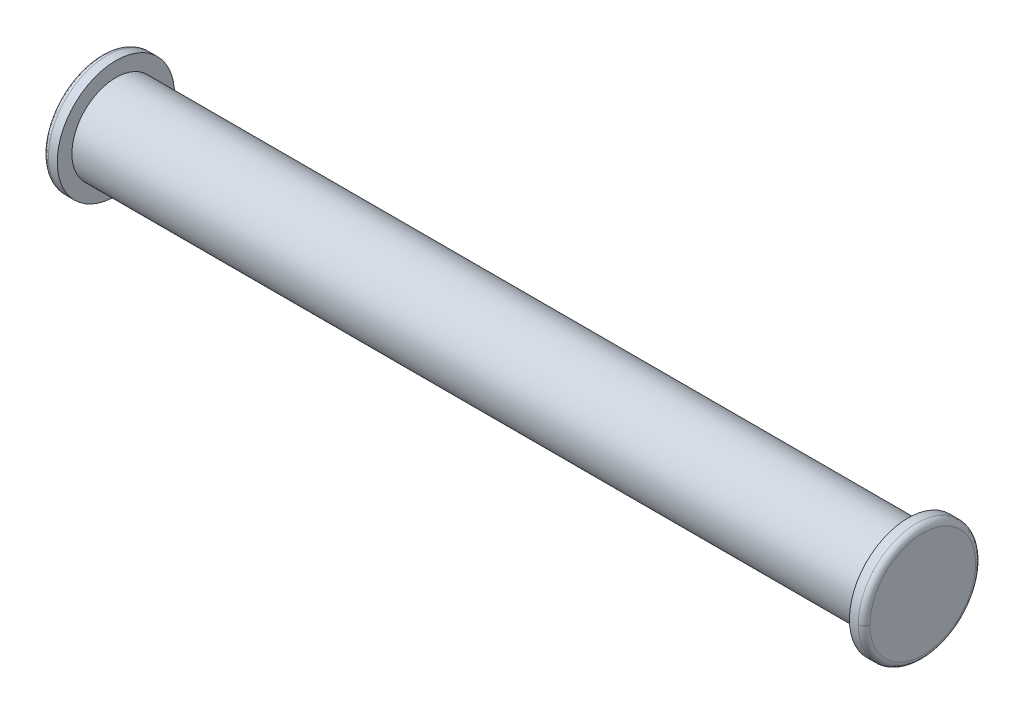
ISO-10303-21;
HEADER;
FILE_DESCRIPTION(('STEP AP214'),'2;1');
FILE_NAME('part.step','',(''),(''),'','','');
FILE_SCHEMA(('AUTOMOTIVE_DESIGN { 1 0 10303 214 1 1 1 1 }'));
ENDSEC;
DATA;
#1=APPLICATION_CONTEXT('core data for automotive mechanical design processes');
#2=APPLICATION_PROTOCOL_DEFINITION('international standard','automotive_design',2000,#1);
#3=PRODUCT_CONTEXT('',#1,'mechanical');
#4=PRODUCT('Part','Part','',(#3));
#5=PRODUCT_RELATED_PRODUCT_CATEGORY('part','',(#4));
#6=PRODUCT_DEFINITION_FORMATION('','',#4);
#7=PRODUCT_DEFINITION_CONTEXT('part definition',#1,'design');
#8=PRODUCT_DEFINITION('design','',#6,#7);
#9=PRODUCT_DEFINITION_SHAPE('','',#8);
#10=(LENGTH_UNIT() NAMED_UNIT(*) SI_UNIT(.MILLI.,.METRE.));
#11=(NAMED_UNIT(*) PLANE_ANGLE_UNIT() SI_UNIT($,.RADIAN.));
#12=(NAMED_UNIT(*) SI_UNIT($,.STERADIAN.) SOLID_ANGLE_UNIT());
#13=UNCERTAINTY_MEASURE_WITH_UNIT(LENGTH_MEASURE(1.E-05),#10,'distance_accuracy_value','');
#14=(GEOMETRIC_REPRESENTATION_CONTEXT(3) GLOBAL_UNCERTAINTY_ASSIGNED_CONTEXT((#13)) GLOBAL_UNIT_ASSIGNED_CONTEXT((#10,
#11,#12)) REPRESENTATION_CONTEXT('',''));
#15=CARTESIAN_POINT('',(0.,0.,0.));
#16=DIRECTION('',(0.,0.,1.));
#17=DIRECTION('',(1.,0.,0.));
#18=AXIS2_PLACEMENT_3D('',#15,#16,#17);
#19=CARTESIAN_POINT('',(14.,-1.8216,1.8216));
#20=DIRECTION('',(1.,0.,0.));
#21=DIRECTION('',(0.,0.,-1.));
#22=AXIS2_PLACEMENT_3D('',#19,#20,#21);
#23=PLANE('',#22);
#24=CARTESIAN_POINT('',(14.0000000000116,0.,1.80000000059265));
#25=CARTESIAN_POINT('',(14.0000000000116,3.60000000031685,1.80000000059265));
#26=CARTESIAN_POINT('',(14.0000000000116,3.60000000031685,-1.80000000059265));
#27=CARTESIAN_POINT('',(14.0000000000116,0.,-1.80000000059265));
#28=(BOUNDED_CURVE() B_SPLINE_CURVE(3,(#24,#25,#26,#27),.UNSPECIFIED.,.F.,
.F.) B_SPLINE_CURVE_WITH_KNOTS((4,4),(0.,1.),
.UNSPECIFIED.) CURVE() GEOMETRIC_REPRESENTATION_ITEM() RATIONAL_B_SPLINE_CURVE((0.956578301732849,
0.318859433910949,0.318859433910949,0.956578301732849)) REPRESENTATION_ITEM(''));
#29=CARTESIAN_POINT('',(14.000000000007,0.,1.79999999995475));
#30=VERTEX_POINT('',#29);
#31=CARTESIAN_POINT('',(14.000000000007,0.,-1.79999999995475));
#32=VERTEX_POINT('',#31);
#33=EDGE_CURVE('E56',#30,#32,#28,.T.);
#34=ORIENTED_EDGE('',*,*,#33,.F.);
#35=CARTESIAN_POINT('',(14.0000000000116,0.,-1.80000000059265));
#36=CARTESIAN_POINT('',(14.0000000000116,-3.60000000031685,-1.80000000059265));
#37=CARTESIAN_POINT('',(14.0000000000116,-3.60000000031685,1.80000000059265));
#38=CARTESIAN_POINT('',(14.0000000000116,0.,1.80000000059265));
#39=(BOUNDED_CURVE() B_SPLINE_CURVE(3,(#35,#36,#37,#38),.UNSPECIFIED.,.F.,
.F.) B_SPLINE_CURVE_WITH_KNOTS((4,4),(0.,1.),
.UNSPECIFIED.) CURVE() GEOMETRIC_REPRESENTATION_ITEM() RATIONAL_B_SPLINE_CURVE((0.956578301732849,
0.318859433910949,0.318859433910949,0.956578301732849)) REPRESENTATION_ITEM(''));
#40=EDGE_CURVE('E62',#32,#30,#39,.T.);
#41=ORIENTED_EDGE('',*,*,#40,.F.);
#42=EDGE_LOOP('',(#34,#41));
#43=FACE_BOUND('',#42,.T.);
#44=ADVANCED_FACE('F17',(#43),#23,.T.);
#45=CARTESIAN_POINT('',(13.999000833,0.,-1.780033317));
#46=CARTESIAN_POINT('',(13.999000833,3.560066633,-1.780033317));
#47=CARTESIAN_POINT('',(13.999000833,3.560066633,1.780033317));
#48=CARTESIAN_POINT('',(13.999000833,0.,1.780033317));
#49=CARTESIAN_POINT('',(14.012644085,0.,-1.916010753));
#50=CARTESIAN_POINT('',(14.012644085,3.832021506,-1.916010753));
#51=CARTESIAN_POINT('',(14.012644085,3.832021506,1.916010753));
#52=CARTESIAN_POINT('',(14.012644085,0.,1.916010753));
#53=CARTESIAN_POINT('',(13.916010753,0.,-2.012644085));
#54=CARTESIAN_POINT('',(13.916010753,4.025288169,-2.012644085));
#55=CARTESIAN_POINT('',(13.916010753,4.025288169,2.012644085));
#56=CARTESIAN_POINT('',(13.916010753,0.,2.012644085));
#57=CARTESIAN_POINT('',(13.780033317,0.,-1.999000833));
#58=CARTESIAN_POINT('',(13.780033317,3.998001666,-1.999000833));
#59=CARTESIAN_POINT('',(13.780033317,3.998001666,1.999000833));
#60=CARTESIAN_POINT('',(13.780033317,0.,1.999000833));
#61=(BOUNDED_SURFACE() B_SPLINE_SURFACE(3,3,((#45,#46,#47,#48),(#49,#50,#51,#52),(#53,#54,#55,
#56),(#57,#58,#59,#60)),.UNSPECIFIED.,.F.,.F.,.F.) B_SPLINE_SURFACE_WITH_KNOTS((4,4),(4,4),(0.,
1.),(0.,1.),.UNSPECIFIED.) GEOMETRIC_REPRESENTATION_ITEM() RATIONAL_B_SPLINE_SURFACE(((1.,
0.333333333333333,0.333333333333333,1.),(0.755320871117973,0.251773623705991,0.251773623705991,
0.755320871117973),(0.755320871117973,0.251773623705991,0.251773623705991,0.755320871117973),
(1.,0.333333333333333,0.333333333333333,1.))) REPRESENTATION_ITEM('') SURFACE());
#62=CARTESIAN_POINT('',(13.999000833,0.,-1.780033317));
#63=CARTESIAN_POINT('',(14.012644085,0.,-1.916010753));
#64=CARTESIAN_POINT('',(13.916010753,0.,-2.012644085));
#65=CARTESIAN_POINT('',(13.780033317,0.,-1.999000833));
#66=(BOUNDED_CURVE() B_SPLINE_CURVE(3,(#62,#63,#64,#65),.UNSPECIFIED.,.F.,
.F.) B_SPLINE_CURVE_WITH_KNOTS((4,4),(0.,1.),
.UNSPECIFIED.) CURVE() GEOMETRIC_REPRESENTATION_ITEM() RATIONAL_B_SPLINE_CURVE((1.,
0.755320871117973,0.755320871117973,1.)) REPRESENTATION_ITEM(''));
#67=CARTESIAN_POINT('',(13.8000000000935,-6.15310285545994E-10,-2.0000000000029));
#68=VERTEX_POINT('',#67);
#69=EDGE_CURVE('E75',#68,#32,#66,.F.);
#70=CARTESIAN_POINT('',(13.8,0.,0.));
#71=DIRECTION('',(-1.,0.,0.));
#72=DIRECTION('',(0.,0.,1.));
#73=AXIS2_PLACEMENT_3D('',#70,#71,#72);
#74=CIRCLE('',#73,2.);
#75=CARTESIAN_POINT('',(13.8,-1.79587256857466E-10,2.0000000000029));
#76=VERTEX_POINT('',#75);
#77=EDGE_CURVE('E71',#68,#76,#74,.F.);
#78=CARTESIAN_POINT('',(13.999000833,0.,1.780033317));
#79=CARTESIAN_POINT('',(14.012644085,0.,1.916010753));
#80=CARTESIAN_POINT('',(13.916010753,0.,2.012644085));
#81=CARTESIAN_POINT('',(13.780033317,0.,1.999000833));
#82=(BOUNDED_CURVE() B_SPLINE_CURVE(3,(#78,#79,#80,#81),.UNSPECIFIED.,.F.,
.F.) B_SPLINE_CURVE_WITH_KNOTS((4,4),(0.,1.),
.UNSPECIFIED.) CURVE() GEOMETRIC_REPRESENTATION_ITEM() RATIONAL_B_SPLINE_CURVE((1.,
0.755320871117973,0.755320871117973,1.)) REPRESENTATION_ITEM(''));
#83=EDGE_CURVE('E65',#30,#76,#82,.T.);
#84=ORIENTED_EDGE('',*,*,#33,.T.);
#85=ORIENTED_EDGE('',*,*,#69,.F.);
#86=ORIENTED_EDGE('',*,*,#77,.T.);
#87=ORIENTED_EDGE('',*,*,#83,.F.);
#88=EDGE_LOOP('',(#84,#85,#86,#87));
#89=FACE_BOUND('',#88,.T.);
#90=ADVANCED_FACE('F69',(#89),#61,.T.);
#91=CARTESIAN_POINT('',(13.999000833,0.,1.780033317));
#92=CARTESIAN_POINT('',(13.999000833,-3.560066633,1.780033317));
#93=CARTESIAN_POINT('',(13.999000833,-3.560066633,-1.780033317));
#94=CARTESIAN_POINT('',(13.999000833,0.,-1.780033317));
#95=CARTESIAN_POINT('',(14.012644085,0.,1.916010753));
#96=CARTESIAN_POINT('',(14.012644085,-3.832021506,1.916010753));
#97=CARTESIAN_POINT('',(14.012644085,-3.832021506,-1.916010753));
#98=CARTESIAN_POINT('',(14.012644085,0.,-1.916010753));
#99=CARTESIAN_POINT('',(13.916010753,0.,2.012644085));
#100=CARTESIAN_POINT('',(13.916010753,-4.025288169,2.012644085));
#101=CARTESIAN_POINT('',(13.916010753,-4.025288169,-2.012644085));
#102=CARTESIAN_POINT('',(13.916010753,0.,-2.012644085));
#103=CARTESIAN_POINT('',(13.780033317,0.,1.999000833));
#104=CARTESIAN_POINT('',(13.780033317,-3.998001666,1.999000833));
#105=CARTESIAN_POINT('',(13.780033317,-3.998001666,-1.999000833));
#106=CARTESIAN_POINT('',(13.780033317,0.,-1.999000833));
#107=(BOUNDED_SURFACE() B_SPLINE_SURFACE(3,3,((#91,#92,#93,#94),(#95,#96,#97,#98),(#99,#100,
#101,#102),(#103,#104,#105,#106)),.UNSPECIFIED.,.F.,.F.,.F.) B_SPLINE_SURFACE_WITH_KNOTS((4,4),
(4,4),(0.,1.),(0.,1.),
.UNSPECIFIED.) GEOMETRIC_REPRESENTATION_ITEM() RATIONAL_B_SPLINE_SURFACE(((1.,0.333333333333333,
0.333333333333333,1.),(0.755320871117973,0.251773623705991,0.251773623705991,0.755320871117973),
(0.755320871117973,0.251773623705991,0.251773623705991,0.755320871117973),(1.,0.333333333333333,
0.333333333333333,1.))) REPRESENTATION_ITEM('') SURFACE());
#108=CARTESIAN_POINT('',(13.8,0.,0.));
#109=DIRECTION('',(-1.,0.,0.));
#110=DIRECTION('',(0.,0.,1.));
#111=AXIS2_PLACEMENT_3D('',#108,#109,#110);
#112=CIRCLE('',#111,2.);
#113=EDGE_CURVE('E170',#76,#68,#112,.F.);
#114=ORIENTED_EDGE('',*,*,#69,.T.);
#115=ORIENTED_EDGE('',*,*,#40,.T.);
#116=ORIENTED_EDGE('',*,*,#83,.T.);
#117=ORIENTED_EDGE('',*,*,#113,.T.);
#118=EDGE_LOOP('',(#114,#115,#116,#117));
#119=FACE_BOUND('',#118,.T.);
#120=ADVANCED_FACE('F78',(#119),#107,.T.);
#121=CARTESIAN_POINT('',(13.8,0.,0.));
#122=DIRECTION('',(-1.,0.,0.));
#123=DIRECTION('',(0.,-1.,0.));
#124=AXIS2_PLACEMENT_3D('',#121,#122,#123);
#125=CYLINDRICAL_SURFACE('',#124,2.);
#126=ORIENTED_EDGE('',*,*,#113,.F.);
#127=ORIENTED_EDGE('',*,*,#77,.F.);
#128=EDGE_LOOP('',(#126,#127));
#129=FACE_BOUND('',#128,.T.);
#130=CARTESIAN_POINT('',(13.5,0.,0.));
#131=DIRECTION('',(-1.,0.,0.));
#132=DIRECTION('',(0.,-1.,0.));
#133=AXIS2_PLACEMENT_3D('',#130,#131,#132);
#134=CIRCLE('',#133,2.);
#135=CARTESIAN_POINT('',(13.5,-2.,0.));
#136=VERTEX_POINT('',#135);
#137=EDGE_CURVE('E22',#136,#136,#134,.F.);
#138=ORIENTED_EDGE('',*,*,#137,.T.);
#139=EDGE_LOOP('',(#138));
#140=FACE_BOUND('',#139,.T.);
#141=ADVANCED_FACE('F98',(#129,#140),#125,.T.);
#142=CARTESIAN_POINT('',(13.5,-2.024,2.024));
#143=DIRECTION('',(1.,0.,0.));
#144=DIRECTION('',(0.,0.,-1.));
#145=AXIS2_PLACEMENT_3D('',#142,#143,#144);
#146=PLANE('',#145);
#147=CARTESIAN_POINT('',(13.5,0.,0.));
#148=DIRECTION('',(-1.,0.,0.));
#149=DIRECTION('',(0.,-1.,0.));
#150=AXIS2_PLACEMENT_3D('',#147,#148,#149);
#151=CIRCLE('',#150,1.5);
#152=CARTESIAN_POINT('',(13.5,-1.5,0.));
#153=VERTEX_POINT('',#152);
#154=EDGE_CURVE('E165',#153,#153,#151,.F.);
#155=ORIENTED_EDGE('',*,*,#154,.T.);
#156=EDGE_LOOP('',(#155));
#157=FACE_BOUND('',#156,.T.);
#158=ORIENTED_EDGE('',*,*,#137,.F.);
#159=EDGE_LOOP('',(#158));
#160=FACE_BOUND('',#159,.T.);
#161=ADVANCED_FACE('F125',(#157,#160),#146,.F.);
#162=CARTESIAN_POINT('',(13.5,0.,0.));
#163=DIRECTION('',(-1.,0.,0.));
#164=DIRECTION('',(0.,-1.,0.));
#165=AXIS2_PLACEMENT_3D('',#162,#163,#164);
#166=CYLINDRICAL_SURFACE('',#165,1.5);
#167=ORIENTED_EDGE('',*,*,#154,.F.);
#168=EDGE_LOOP('',(#167));
#169=FACE_BOUND('',#168,.T.);
#170=CARTESIAN_POINT('',(-13.5,0.,0.));
#171=DIRECTION('',(-1.,0.,0.));
#172=DIRECTION('',(0.,-1.,0.));
#173=AXIS2_PLACEMENT_3D('',#170,#171,#172);
#174=CIRCLE('',#173,1.5);
#175=CARTESIAN_POINT('',(-13.5,-1.50000000000002,0.));
#176=VERTEX_POINT('',#175);
#177=EDGE_CURVE('E162',#176,#176,#174,.F.);
#178=ORIENTED_EDGE('',*,*,#177,.T.);
#179=EDGE_LOOP('',(#178));
#180=FACE_BOUND('',#179,.T.);
#181=ADVANCED_FACE('F231',(#169,#180),#166,.T.);
#182=CARTESIAN_POINT('',(-13.5,-2.024,-2.024));
#183=DIRECTION('',(-1.,0.,0.));
#184=DIRECTION('',(0.,0.,1.));
#185=AXIS2_PLACEMENT_3D('',#182,#183,#184);
#186=PLANE('',#185);
#187=ORIENTED_EDGE('',*,*,#177,.F.);
#188=EDGE_LOOP('',(#187));
#189=FACE_BOUND('',#188,.T.);
#190=CARTESIAN_POINT('',(-13.5,0.,0.));
#191=DIRECTION('',(1.,0.,0.));
#192=DIRECTION('',(0.,1.,0.));
#193=AXIS2_PLACEMENT_3D('',#190,#191,#192);
#194=CIRCLE('',#193,2.);
#195=CARTESIAN_POINT('',(-13.5,2.,0.));
#196=VERTEX_POINT('',#195);
#197=EDGE_CURVE('E154',#196,#196,#194,.T.);
#198=ORIENTED_EDGE('',*,*,#197,.T.);
#199=EDGE_LOOP('',(#198));
#200=FACE_BOUND('',#199,.T.);
#201=ADVANCED_FACE('F229',(#189,#200),#186,.F.);
#202=CARTESIAN_POINT('',(-13.999000833,0.,-1.780033317));
#203=CARTESIAN_POINT('',(-13.999000833,-3.560066633,-1.780033317));
#204=CARTESIAN_POINT('',(-13.999000833,-3.560066633,1.780033317));
#205=CARTESIAN_POINT('',(-13.999000833,0.,1.780033317));
#206=CARTESIAN_POINT('',(-14.012644085,0.,-1.916010753));
#207=CARTESIAN_POINT('',(-14.012644085,-3.832021506,-1.916010753));
#208=CARTESIAN_POINT('',(-14.012644085,-3.832021506,1.916010753));
#209=CARTESIAN_POINT('',(-14.012644085,0.,1.916010753));
#210=CARTESIAN_POINT('',(-13.916010753,0.,-2.012644085));
#211=CARTESIAN_POINT('',(-13.916010753,-4.025288169,-2.012644085));
#212=CARTESIAN_POINT('',(-13.916010753,-4.025288169,2.012644085));
#213=CARTESIAN_POINT('',(-13.916010753,0.,2.012644085));
#214=CARTESIAN_POINT('',(-13.780033317,0.,-1.999000833));
#215=CARTESIAN_POINT('',(-13.780033317,-3.998001666,-1.999000833));
#216=CARTESIAN_POINT('',(-13.780033317,-3.998001666,1.999000833));
#217=CARTESIAN_POINT('',(-13.780033317,0.,1.999000833));
#218=(BOUNDED_SURFACE() B_SPLINE_SURFACE(3,3,((#202,#203,#204,#205),(#206,#207,#208,#209),(#210,
#211,#212,#213),(#214,#215,#216,#217)),.UNSPECIFIED.,.F.,.F.,
.F.) B_SPLINE_SURFACE_WITH_KNOTS((4,4),(4,4),(0.,1.),(0.,1.),
.UNSPECIFIED.) GEOMETRIC_REPRESENTATION_ITEM() RATIONAL_B_SPLINE_SURFACE(((1.,0.333333333333333,
0.333333333333333,1.),(0.755320871117973,0.251773623705991,0.251773623705991,0.755320871117973),
(0.755320871117973,0.251773623705991,0.251773623705991,0.755320871117973),(1.,0.333333333333333,
0.333333333333333,1.))) REPRESENTATION_ITEM('') SURFACE());
#219=CARTESIAN_POINT('',(-13.999000833,0.,1.780033317));
#220=CARTESIAN_POINT('',(-14.012644085,0.,1.916010753));
#221=CARTESIAN_POINT('',(-13.916010753,0.,2.012644085));
#222=CARTESIAN_POINT('',(-13.780033317,0.,1.999000833));
#223=(BOUNDED_CURVE() B_SPLINE_CURVE(3,(#219,#220,#221,#222),.UNSPECIFIED.,.F.,
.F.) B_SPLINE_CURVE_WITH_KNOTS((4,4),(0.,1.),
.UNSPECIFIED.) CURVE() GEOMETRIC_REPRESENTATION_ITEM() RATIONAL_B_SPLINE_CURVE((1.,
0.755320871117973,0.755320871117973,1.)) REPRESENTATION_ITEM(''));
#224=CARTESIAN_POINT('',(-13.8000000002805,-4.10206857031257E-10,2.00000000000871));
#225=VERTEX_POINT('',#224);
#226=CARTESIAN_POINT('',(-14.000000000007,0.,1.79999999995475));
#227=VERTEX_POINT('',#226);
#228=EDGE_CURVE('E36',#225,#227,#223,.F.);
#229=CARTESIAN_POINT('',(-14.0000000000116,0.,1.80000000059265));
#230=CARTESIAN_POINT('',(-14.0000000000116,-3.60000000031685,1.80000000059265));
#231=CARTESIAN_POINT('',(-14.0000000000116,-3.60000000031685,-1.80000000059265));
#232=CARTESIAN_POINT('',(-14.0000000000116,0.,-1.80000000059265));
#233=(BOUNDED_CURVE() B_SPLINE_CURVE(3,(#229,#230,#231,#232),.UNSPECIFIED.,.F.,
.F.) B_SPLINE_CURVE_WITH_KNOTS((4,4),(0.,1.),
.UNSPECIFIED.) CURVE() GEOMETRIC_REPRESENTATION_ITEM() RATIONAL_B_SPLINE_CURVE((0.956578301732849,
0.318859433910949,0.318859433910949,0.956578301732849)) REPRESENTATION_ITEM(''));
#234=CARTESIAN_POINT('',(-14.000000000007,0.,-1.79999999995475));
#235=VERTEX_POINT('',#234);
#236=EDGE_CURVE('E150',#235,#227,#233,.F.);
#237=CARTESIAN_POINT('',(-13.999000833,0.,-1.780033317));
#238=CARTESIAN_POINT('',(-14.012644085,0.,-1.916010753));
#239=CARTESIAN_POINT('',(-13.916010753,0.,-2.012644085));
#240=CARTESIAN_POINT('',(-13.780033317,0.,-1.999000833));
#241=(BOUNDED_CURVE() B_SPLINE_CURVE(3,(#237,#238,#239,#240),.UNSPECIFIED.,.F.,
.F.) B_SPLINE_CURVE_WITH_KNOTS((4,4),(0.,1.),
.UNSPECIFIED.) CURVE() GEOMETRIC_REPRESENTATION_ITEM() RATIONAL_B_SPLINE_CURVE((1.,
0.755320871117973,0.755320871117973,1.)) REPRESENTATION_ITEM(''));
#242=CARTESIAN_POINT('',(-13.800000000374,-8.9793628428733E-11,-2.00000000000871));
#243=VERTEX_POINT('',#242);
#244=EDGE_CURVE('E164',#235,#243,#241,.T.);
#245=CARTESIAN_POINT('',(-13.800000000374,0.,0.));
#246=DIRECTION('',(-1.,0.,0.));
#247=DIRECTION('',(0.,-1.,0.));
#248=AXIS2_PLACEMENT_3D('',#245,#246,#247);
#249=CIRCLE('',#248,2.00000000001161);
#250=EDGE_CURVE('E190',#243,#225,#249,.T.);
#251=ORIENTED_EDGE('',*,*,#228,.T.);
#252=ORIENTED_EDGE('',*,*,#236,.F.);
#253=ORIENTED_EDGE('',*,*,#244,.T.);
#254=ORIENTED_EDGE('',*,*,#250,.T.);
#255=EDGE_LOOP('',(#251,#252,#253,#254));
#256=FACE_BOUND('',#255,.T.);
#257=ADVANCED_FACE('F217',(#256),#218,.T.);
#258=CARTESIAN_POINT('',(-13.8,0.,0.));
#259=DIRECTION('',(1.,0.,0.));
#260=DIRECTION('',(0.,1.,0.));
#261=AXIS2_PLACEMENT_3D('',#258,#259,#260);
#262=CYLINDRICAL_SURFACE('',#261,2.);
#263=ORIENTED_EDGE('',*,*,#250,.F.);
#264=CARTESIAN_POINT('',(-13.800000000374,0.,0.));
#265=DIRECTION('',(-1.,0.,0.));
#266=DIRECTION('',(0.,-1.,0.));
#267=AXIS2_PLACEMENT_3D('',#264,#265,#266);
#268=CIRCLE('',#267,2.00000000001161);
#269=EDGE_CURVE('E28',#225,#243,#268,.T.);
#270=ORIENTED_EDGE('',*,*,#269,.F.);
#271=EDGE_LOOP('',(#263,#270));
#272=FACE_BOUND('',#271,.T.);
#273=ORIENTED_EDGE('',*,*,#197,.F.);
#274=EDGE_LOOP('',(#273));
#275=FACE_BOUND('',#274,.T.);
#276=ADVANCED_FACE('F228',(#272,#275),#262,.T.);
#277=CARTESIAN_POINT('',(-14.,-1.8216,-1.8216));
#278=DIRECTION('',(-1.,0.,0.));
#279=DIRECTION('',(0.,0.,1.));
#280=AXIS2_PLACEMENT_3D('',#277,#278,#279);
#281=PLANE('',#280);
#282=CARTESIAN_POINT('',(-14.0000000000116,0.,-1.80000000059265));
#283=CARTESIAN_POINT('',(-14.0000000000116,3.60000000031685,-1.80000000059265));
#284=CARTESIAN_POINT('',(-14.0000000000116,3.60000000031685,1.80000000059265));
#285=CARTESIAN_POINT('',(-14.0000000000116,0.,1.80000000059265));
#286=(BOUNDED_CURVE() B_SPLINE_CURVE(3,(#282,#283,#284,#285),.UNSPECIFIED.,.F.,
.F.) B_SPLINE_CURVE_WITH_KNOTS((4,4),(0.,1.),
.UNSPECIFIED.) CURVE() GEOMETRIC_REPRESENTATION_ITEM() RATIONAL_B_SPLINE_CURVE((0.956578301732849,
0.318859433910949,0.318859433910949,0.956578301732849)) REPRESENTATION_ITEM(''));
#287=EDGE_CURVE('E11',#235,#227,#286,.T.);
#288=ORIENTED_EDGE('',*,*,#287,.F.);
#289=ORIENTED_EDGE('',*,*,#236,.T.);
#290=EDGE_LOOP('',(#288,#289));
#291=FACE_BOUND('',#290,.T.);
#292=ADVANCED_FACE('F19',(#291),#281,.T.);
#293=CARTESIAN_POINT('',(-13.999000833,0.,1.780033317));
#294=CARTESIAN_POINT('',(-13.999000833,3.560066633,1.780033317));
#295=CARTESIAN_POINT('',(-13.999000833,3.560066633,-1.780033317));
#296=CARTESIAN_POINT('',(-13.999000833,0.,-1.780033317));
#297=CARTESIAN_POINT('',(-14.012644085,0.,1.916010753));
#298=CARTESIAN_POINT('',(-14.012644085,3.832021506,1.916010753));
#299=CARTESIAN_POINT('',(-14.012644085,3.832021506,-1.916010753));
#300=CARTESIAN_POINT('',(-14.012644085,0.,-1.916010753));
#301=CARTESIAN_POINT('',(-13.916010753,0.,2.012644085));
#302=CARTESIAN_POINT('',(-13.916010753,4.025288169,2.012644085));
#303=CARTESIAN_POINT('',(-13.916010753,4.025288169,-2.012644085));
#304=CARTESIAN_POINT('',(-13.916010753,0.,-2.012644085));
#305=CARTESIAN_POINT('',(-13.780033317,0.,1.999000833));
#306=CARTESIAN_POINT('',(-13.780033317,3.998001666,1.999000833));
#307=CARTESIAN_POINT('',(-13.780033317,3.998001666,-1.999000833));
#308=CARTESIAN_POINT('',(-13.780033317,0.,-1.999000833));
#309=(BOUNDED_SURFACE() B_SPLINE_SURFACE(3,3,((#293,#294,#295,#296),(#297,#298,#299,#300),(#301,
#302,#303,#304),(#305,#306,#307,#308)),.UNSPECIFIED.,.F.,.F.,
.F.) B_SPLINE_SURFACE_WITH_KNOTS((4,4),(4,4),(0.,1.),(0.,1.),
.UNSPECIFIED.) GEOMETRIC_REPRESENTATION_ITEM() RATIONAL_B_SPLINE_SURFACE(((1.,0.333333333333333,
0.333333333333333,1.),(0.755320871117973,0.251773623705991,0.251773623705991,0.755320871117973),
(0.755320871117973,0.251773623705991,0.251773623705991,0.755320871117973),(1.,0.333333333333333,
0.333333333333333,1.))) REPRESENTATION_ITEM('') SURFACE());
#310=ORIENTED_EDGE('',*,*,#287,.T.);
#311=ORIENTED_EDGE('',*,*,#228,.F.);
#312=ORIENTED_EDGE('',*,*,#269,.T.);
#313=ORIENTED_EDGE('',*,*,#244,.F.);
#314=EDGE_LOOP('',(#310,#311,#312,#313));
#315=FACE_BOUND('',#314,.T.);
#316=ADVANCED_FACE('F246',(#315),#309,.T.);
#317=CLOSED_SHELL('',(#44,#90,#120,#141,#161,#181,#201,#257,#276,#292,#316));
#318=MANIFOLD_SOLID_BREP('B1',#317);
#319=ADVANCED_BREP_SHAPE_REPRESENTATION('',(#18,#318),#14);
#320=SHAPE_DEFINITION_REPRESENTATION(#9,#319);
ENDSEC;
END-ISO-10303-21;
